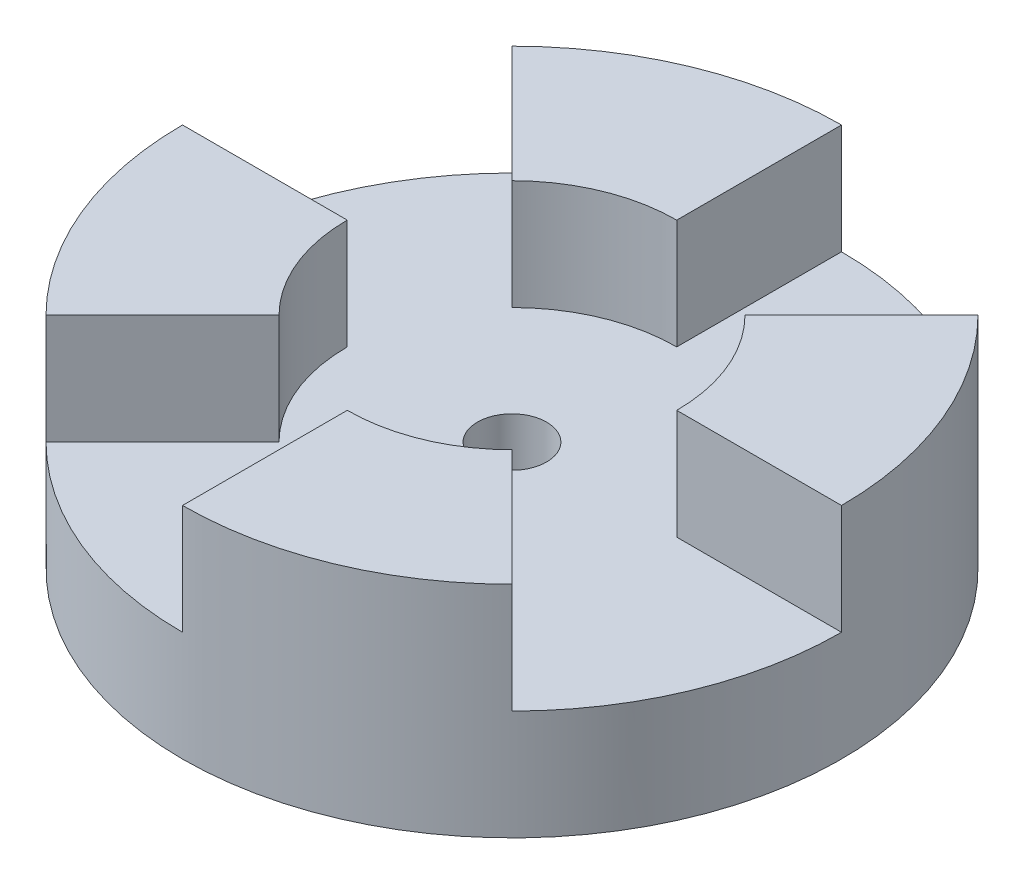
ISO-10303-21;
HEADER;
FILE_DESCRIPTION(('STEP AP214'),'2;1');
FILE_NAME('part.step','',(''),(''),'','','');
FILE_SCHEMA(('AUTOMOTIVE_DESIGN { 1 0 10303 214 1 1 1 1 }'));
ENDSEC;
DATA;
#1=APPLICATION_CONTEXT('core data for automotive mechanical design processes');
#2=APPLICATION_PROTOCOL_DEFINITION('international standard','automotive_design',2000,#1);
#3=PRODUCT_CONTEXT('',#1,'mechanical');
#4=PRODUCT('Part','Part','',(#3));
#5=PRODUCT_RELATED_PRODUCT_CATEGORY('part','',(#4));
#6=PRODUCT_DEFINITION_FORMATION('','',#4);
#7=PRODUCT_DEFINITION_CONTEXT('part definition',#1,'design');
#8=PRODUCT_DEFINITION('design','',#6,#7);
#9=PRODUCT_DEFINITION_SHAPE('','',#8);
#10=(LENGTH_UNIT() NAMED_UNIT(*) SI_UNIT(.MILLI.,.METRE.));
#11=(NAMED_UNIT(*) PLANE_ANGLE_UNIT() SI_UNIT($,.RADIAN.));
#12=(NAMED_UNIT(*) SI_UNIT($,.STERADIAN.) SOLID_ANGLE_UNIT());
#13=UNCERTAINTY_MEASURE_WITH_UNIT(LENGTH_MEASURE(1.E-05),#10,'distance_accuracy_value','');
#14=(GEOMETRIC_REPRESENTATION_CONTEXT(3) GLOBAL_UNCERTAINTY_ASSIGNED_CONTEXT((#13)) GLOBAL_UNIT_ASSIGNED_CONTEXT((#10,
#11,#12)) REPRESENTATION_CONTEXT('',''));
#15=CARTESIAN_POINT('',(0.,0.,0.));
#16=DIRECTION('',(0.,0.,1.));
#17=DIRECTION('',(1.,0.,0.));
#18=AXIS2_PLACEMENT_3D('',#15,#16,#17);
#19=CARTESIAN_POINT('',(-80.7898587765487,0.,8.41561028922383));
#20=DIRECTION('',(0.,1.,0.));
#21=DIRECTION('',(0.,0.,1.));
#22=AXIS2_PLACEMENT_3D('',#19,#20,#21);
#23=CYLINDRICAL_SURFACE('',#22,4.00050000000001);
#24=CARTESIAN_POINT('',(-80.7898587765487,12.7,8.41561028922383));
#25=DIRECTION('',(0.,1.,0.));
#26=DIRECTION('',(0.,0.,1.));
#27=AXIS2_PLACEMENT_3D('',#24,#25,#26);
#28=CIRCLE('',#27,4.00050000000001);
#29=CARTESIAN_POINT('',(-80.7898587765487,12.7,12.4161102892238));
#30=VERTEX_POINT('',#29);
#31=EDGE_CURVE('E350',#30,#30,#28,.T.);
#32=ORIENTED_EDGE('',*,*,#31,.T.);
#33=EDGE_LOOP('',(#32));
#34=FACE_BOUND('',#33,.T.);
#35=CARTESIAN_POINT('',(-80.7898587765487,2.54,8.41561028922383));
#36=DIRECTION('',(0.,-1.,0.));
#37=DIRECTION('',(0.,0.,-1.));
#38=AXIS2_PLACEMENT_3D('',#35,#36,#37);
#39=CIRCLE('',#38,4.00050000000001);
#40=CARTESIAN_POINT('',(-80.7898587765487,2.54,4.41511028922382));
#41=VERTEX_POINT('',#40);
#42=EDGE_CURVE('E38',#41,#41,#39,.F.);
#43=ORIENTED_EDGE('',*,*,#42,.F.);
#44=EDGE_LOOP('',(#43));
#45=FACE_BOUND('',#44,.T.);
#46=ADVANCED_FACE('F34',(#34,#45),#23,.F.);
#47=CARTESIAN_POINT('',(-80.7898587765487,12.7,8.41561028922383));
#48=DIRECTION('',(0.,1.,0.));
#49=DIRECTION('',(0.,0.,1.));
#50=AXIS2_PLACEMENT_3D('',#47,#48,#49);
#51=PLANE('',#50);
#52=ORIENTED_EDGE('',*,*,#31,.F.);
#53=EDGE_LOOP('',(#52));
#54=FACE_BOUND('',#53,.T.);
#55=CARTESIAN_POINT('',(-80.7898587765487,12.7,8.41561028922383));
#56=DIRECTION('',(0.,1.,0.));
#57=DIRECTION('',(0.,0.,1.));
#58=AXIS2_PLACEMENT_3D('',#55,#56,#57);
#59=CIRCLE('',#58,38.1);
#60=CARTESIAN_POINT('',(-107.730627139756,12.7,-18.5251580739836));
#61=VERTEX_POINT('',#60);
#62=CARTESIAN_POINT('',(-118.889858776549,12.7,8.41561028922383));
#63=VERTEX_POINT('',#62);
#64=EDGE_CURVE('E11',#61,#63,#59,.T.);
#65=ORIENTED_EDGE('',*,*,#64,.T.);
#66=DIRECTION('',(-1.,0.,0.));
#67=VECTOR('',#66,1.);
#68=CARTESIAN_POINT('',(-164.751280132786,12.7,8.41561028922383));
#69=LINE('',#68,#67);
#70=CARTESIAN_POINT('',(-99.8398587765487,12.7,8.41561028922383));
#71=VERTEX_POINT('',#70);
#72=EDGE_CURVE('E50',#71,#63,#69,.T.);
#73=ORIENTED_EDGE('',*,*,#72,.F.);
#74=CARTESIAN_POINT('',(-80.7898587765487,12.7,8.41561028922383));
#75=DIRECTION('',(0.,1.,0.));
#76=DIRECTION('',(0.,0.,1.));
#77=AXIS2_PLACEMENT_3D('',#74,#75,#76);
#78=CIRCLE('',#77,19.05);
#79=CARTESIAN_POINT('',(-94.2602429581524,12.7,21.8859944708276));
#80=VERTEX_POINT('',#79);
#81=EDGE_CURVE('E55',#71,#80,#78,.T.);
#82=ORIENTED_EDGE('',*,*,#81,.T.);
#83=DIRECTION('',(-0.707106781186548,0.,0.707106781186548));
#84=VECTOR('',#83,1.);
#85=CARTESIAN_POINT('',(-122.770569454667,12.7,50.3963209673425));
#86=LINE('',#85,#84);
#87=CARTESIAN_POINT('',(-107.730627139756,12.7,35.3563786524313));
#88=VERTEX_POINT('',#87);
#89=EDGE_CURVE('E168',#80,#88,#86,.T.);
#90=ORIENTED_EDGE('',*,*,#89,.T.);
#91=CARTESIAN_POINT('',(-80.7898587765487,12.7,46.5156102892238));
#92=VERTEX_POINT('',#91);
#93=EDGE_CURVE('E43',#88,#92,#59,.T.);
#94=ORIENTED_EDGE('',*,*,#93,.T.);
#95=DIRECTION('',(0.,0.,1.));
#96=VECTOR('',#95,1.);
#97=CARTESIAN_POINT('',(-80.7898587765487,12.7,8.41561028922383));
#98=LINE('',#97,#96);
#99=CARTESIAN_POINT('',(-80.7898587765487,12.7,27.4656102892238));
#100=VERTEX_POINT('',#99);
#101=EDGE_CURVE('E198',#100,#92,#98,.T.);
#102=ORIENTED_EDGE('',*,*,#101,.F.);
#103=CARTESIAN_POINT('',(-80.7898587765487,12.7,8.41561028922381));
#104=DIRECTION('',(0.,1.,0.));
#105=DIRECTION('',(0.,0.,1.));
#106=AXIS2_PLACEMENT_3D('',#103,#104,#105);
#107=CIRCLE('',#106,19.05);
#108=CARTESIAN_POINT('',(-67.319474594945,12.7,21.8859944708276));
#109=VERTEX_POINT('',#108);
#110=EDGE_CURVE('E154',#100,#109,#107,.T.);
#111=ORIENTED_EDGE('',*,*,#110,.T.);
#112=DIRECTION('',(0.707106781186547,0.,0.707106781186548));
#113=VECTOR('',#112,1.);
#114=CARTESIAN_POINT('',(-122.770569454667,12.7,-33.5651003888948));
#115=LINE('',#114,#113);
#116=CARTESIAN_POINT('',(-53.8490904133412,12.7,35.3563786524313));
#117=VERTEX_POINT('',#116);
#118=EDGE_CURVE('E189',#109,#117,#115,.T.);
#119=ORIENTED_EDGE('',*,*,#118,.T.);
#120=CARTESIAN_POINT('',(-42.6898587765487,12.7,8.41561028922383));
#121=VERTEX_POINT('',#120);
#122=EDGE_CURVE('E282',#117,#121,#59,.T.);
#123=ORIENTED_EDGE('',*,*,#122,.T.);
#124=DIRECTION('',(1.,0.,0.));
#125=VECTOR('',#124,1.);
#126=CARTESIAN_POINT('',(-164.751280132786,12.7,8.41561028922383));
#127=LINE('',#126,#125);
#128=CARTESIAN_POINT('',(-61.7398587765487,12.7,8.41561028922383));
#129=VERTEX_POINT('',#128);
#130=EDGE_CURVE('E219',#129,#121,#127,.T.);
#131=ORIENTED_EDGE('',*,*,#130,.F.);
#132=CARTESIAN_POINT('',(-80.7898587765487,12.7,8.41561028922383));
#133=DIRECTION('',(0.,1.,0.));
#134=DIRECTION('',(0.,0.,1.));
#135=AXIS2_PLACEMENT_3D('',#132,#133,#134);
#136=CIRCLE('',#135,19.05);
#137=CARTESIAN_POINT('',(-67.3194745949449,12.7,-5.0547738923799));
#138=VERTEX_POINT('',#137);
#139=EDGE_CURVE('E228',#138,#129,#136,.F.);
#140=ORIENTED_EDGE('',*,*,#139,.F.);
#141=DIRECTION('',(0.707106781186548,0.,-0.707106781186548));
#142=VECTOR('',#141,1.);
#143=CARTESIAN_POINT('',(-122.770569454667,12.7,50.3963209673425));
#144=LINE('',#143,#142);
#145=CARTESIAN_POINT('',(-53.8490904133412,12.7,-18.5251580739836));
#146=VERTEX_POINT('',#145);
#147=EDGE_CURVE('E214',#138,#146,#144,.T.);
#148=ORIENTED_EDGE('',*,*,#147,.T.);
#149=CARTESIAN_POINT('',(-80.7898587765487,12.7,-29.6843897107762));
#150=VERTEX_POINT('',#149);
#151=EDGE_CURVE('E280',#146,#150,#59,.T.);
#152=ORIENTED_EDGE('',*,*,#151,.T.);
#153=DIRECTION('',(0.,0.,-1.));
#154=VECTOR('',#153,1.);
#155=CARTESIAN_POINT('',(-80.7898587765487,12.7,8.41561028922383));
#156=LINE('',#155,#154);
#157=CARTESIAN_POINT('',(-80.7898587765487,12.7,-10.6343897107762));
#158=VERTEX_POINT('',#157);
#159=EDGE_CURVE('E258',#158,#150,#156,.T.);
#160=ORIENTED_EDGE('',*,*,#159,.F.);
#161=CARTESIAN_POINT('',(-80.7898587765487,12.7,8.41561028922383));
#162=DIRECTION('',(0.,1.,0.));
#163=DIRECTION('',(0.,0.,1.));
#164=AXIS2_PLACEMENT_3D('',#161,#162,#163);
#165=CIRCLE('',#164,19.05);
#166=CARTESIAN_POINT('',(-94.2602429581524,12.7,-5.05477389237991));
#167=VERTEX_POINT('',#166);
#168=EDGE_CURVE('E244',#158,#167,#165,.T.);
#169=ORIENTED_EDGE('',*,*,#168,.T.);
#170=DIRECTION('',(-0.707106781186548,0.,-0.707106781186547));
#171=VECTOR('',#170,1.);
#172=CARTESIAN_POINT('',(-122.770569454667,12.7,-33.5651003888948));
#173=LINE('',#172,#171);
#174=EDGE_CURVE('E249',#167,#61,#173,.T.);
#175=ORIENTED_EDGE('',*,*,#174,.T.);
#176=EDGE_LOOP('',(#65,#73,#82,#90,#94,#102,#111,#119,#123,#131,#140,#148,#152,#160,#169,#175));
#177=FACE_BOUND('',#176,.T.);
#178=ADVANCED_FACE('F290',(#54,#177),#51,.T.);
#179=CARTESIAN_POINT('',(-80.7898587765487,12.7,8.41561028922383));
#180=DIRECTION('',(0.,-1.,0.));
#181=DIRECTION('',(0.,0.,-1.));
#182=AXIS2_PLACEMENT_3D('',#179,#180,#181);
#183=CYLINDRICAL_SURFACE('',#182,38.1);
#184=ORIENTED_EDGE('',*,*,#64,.F.);
#185=DIRECTION('',(0.,-1.,0.));
#186=VECTOR('',#185,1.);
#187=CARTESIAN_POINT('',(-107.730627139756,25.4,-18.5251580739836));
#188=LINE('',#187,#186);
#189=CARTESIAN_POINT('',(-107.730627139756,25.4,-18.5251580739836));
#190=VERTEX_POINT('',#189);
#191=EDGE_CURVE('E270',#190,#61,#188,.T.);
#192=ORIENTED_EDGE('',*,*,#191,.F.);
#193=CARTESIAN_POINT('',(-80.7898587765487,25.4,8.41561028922383));
#194=DIRECTION('',(0.,1.,0.));
#195=DIRECTION('',(0.,0.,1.));
#196=AXIS2_PLACEMENT_3D('',#193,#194,#195);
#197=CIRCLE('',#196,38.1);
#198=CARTESIAN_POINT('',(-80.7898587765487,25.4,-29.6843897107762));
#199=VERTEX_POINT('',#198);
#200=EDGE_CURVE('E251',#199,#190,#197,.T.);
#201=ORIENTED_EDGE('',*,*,#200,.F.);
#202=DIRECTION('',(0.,-1.,0.));
#203=VECTOR('',#202,1.);
#204=CARTESIAN_POINT('',(-80.7898587765487,25.4,-29.6843897107762));
#205=LINE('',#204,#203);
#206=EDGE_CURVE('E266',#199,#150,#205,.T.);
#207=ORIENTED_EDGE('',*,*,#206,.T.);
#208=ORIENTED_EDGE('',*,*,#151,.F.);
#209=DIRECTION('',(0.,-1.,0.));
#210=VECTOR('',#209,1.);
#211=CARTESIAN_POINT('',(-53.8490904133412,25.4,-18.5251580739836));
#212=LINE('',#211,#210);
#213=CARTESIAN_POINT('',(-53.8490904133412,25.4,-18.5251580739836));
#214=VERTEX_POINT('',#213);
#215=EDGE_CURVE('E225',#214,#146,#212,.T.);
#216=ORIENTED_EDGE('',*,*,#215,.F.);
#217=CARTESIAN_POINT('',(-80.7898587765487,25.4,8.41561028922383));
#218=DIRECTION('',(0.,1.,0.));
#219=DIRECTION('',(0.,0.,1.));
#220=AXIS2_PLACEMENT_3D('',#217,#218,#219);
#221=CIRCLE('',#220,38.1);
#222=CARTESIAN_POINT('',(-42.6898587765487,25.4,8.41561028922383));
#223=VERTEX_POINT('',#222);
#224=EDGE_CURVE('E223',#223,#214,#221,.T.);
#225=ORIENTED_EDGE('',*,*,#224,.F.);
#226=DIRECTION('',(0.,-1.,0.));
#227=VECTOR('',#226,1.);
#228=CARTESIAN_POINT('',(-42.6898587765487,25.4,8.41561028922383));
#229=LINE('',#228,#227);
#230=EDGE_CURVE('E235',#223,#121,#229,.T.);
#231=ORIENTED_EDGE('',*,*,#230,.T.);
#232=ORIENTED_EDGE('',*,*,#122,.F.);
#233=DIRECTION('',(0.,-1.,0.));
#234=VECTOR('',#233,1.);
#235=CARTESIAN_POINT('',(-53.8490904133412,25.4,35.3563786524313));
#236=LINE('',#235,#234);
#237=CARTESIAN_POINT('',(-53.8490904133412,25.4,35.3563786524313));
#238=VERTEX_POINT('',#237);
#239=EDGE_CURVE('E205',#238,#117,#236,.T.);
#240=ORIENTED_EDGE('',*,*,#239,.F.);
#241=CARTESIAN_POINT('',(-80.7898587765487,25.4,8.41561028922383));
#242=DIRECTION('',(0.,1.,0.));
#243=DIRECTION('',(0.,0.,1.));
#244=AXIS2_PLACEMENT_3D('',#241,#242,#243);
#245=CIRCLE('',#244,38.1);
#246=CARTESIAN_POINT('',(-80.7898587765487,25.4,46.5156102892238));
#247=VERTEX_POINT('',#246);
#248=EDGE_CURVE('E191',#247,#238,#245,.T.);
#249=ORIENTED_EDGE('',*,*,#248,.F.);
#250=DIRECTION('',(0.,-1.,0.));
#251=VECTOR('',#250,1.);
#252=CARTESIAN_POINT('',(-80.7898587765487,25.4,46.5156102892238));
#253=LINE('',#252,#251);
#254=EDGE_CURVE('E208',#247,#92,#253,.T.);
#255=ORIENTED_EDGE('',*,*,#254,.T.);
#256=ORIENTED_EDGE('',*,*,#93,.F.);
#257=DIRECTION('',(0.,-1.,0.));
#258=VECTOR('',#257,1.);
#259=CARTESIAN_POINT('',(-107.730627139756,25.4,35.3563786524313));
#260=LINE('',#259,#258);
#261=CARTESIAN_POINT('',(-107.730627139756,25.4,35.3563786524313));
#262=VERTEX_POINT('',#261);
#263=EDGE_CURVE('E181',#262,#88,#260,.T.);
#264=ORIENTED_EDGE('',*,*,#263,.F.);
#265=CARTESIAN_POINT('',(-80.7898587765487,25.4,8.41561028922383));
#266=DIRECTION('',(0.,1.,0.));
#267=DIRECTION('',(0.,0.,1.));
#268=AXIS2_PLACEMENT_3D('',#265,#266,#267);
#269=CIRCLE('',#268,38.1);
#270=CARTESIAN_POINT('',(-118.889858776549,25.4,8.41561028922383));
#271=VERTEX_POINT('',#270);
#272=EDGE_CURVE('E163',#271,#262,#269,.T.);
#273=ORIENTED_EDGE('',*,*,#272,.F.);
#274=DIRECTION('',(0.,-1.,0.));
#275=VECTOR('',#274,1.);
#276=CARTESIAN_POINT('',(-118.889858776549,25.4,8.41561028922383));
#277=LINE('',#276,#275);
#278=EDGE_CURVE('E155',#271,#63,#277,.T.);
#279=ORIENTED_EDGE('',*,*,#278,.T.);
#280=EDGE_LOOP('',(#184,#192,#201,#207,#208,#216,#225,#231,#232,#240,#249,#255,#256,#264,#273,#279));
#281=FACE_BOUND('',#280,.T.);
#282=CARTESIAN_POINT('',(-80.7898587765487,0.,8.41561028922383));
#283=DIRECTION('',(0.,1.,0.));
#284=DIRECTION('',(0.,0.,1.));
#285=AXIS2_PLACEMENT_3D('',#282,#283,#284);
#286=CIRCLE('',#285,38.1);
#287=CARTESIAN_POINT('',(-80.7898587765487,0.,46.5156102892238));
#288=VERTEX_POINT('',#287);
#289=EDGE_CURVE('E283',#288,#288,#286,.T.);
#290=ORIENTED_EDGE('',*,*,#289,.T.);
#291=EDGE_LOOP('',(#290));
#292=FACE_BOUND('',#291,.T.);
#293=ADVANCED_FACE('F36',(#281,#292),#183,.T.);
#294=CARTESIAN_POINT('',(-80.7898587765487,0.,8.41561028922383));
#295=DIRECTION('',(0.,1.,0.));
#296=DIRECTION('',(0.,0.,1.));
#297=AXIS2_PLACEMENT_3D('',#294,#295,#296);
#298=PLANE('',#297);
#299=CARTESIAN_POINT('',(-80.7898587765487,0.,8.41561028922383));
#300=DIRECTION('',(0.,-1.,0.));
#301=DIRECTION('',(0.,0.,-1.));
#302=AXIS2_PLACEMENT_3D('',#299,#300,#301);
#303=CIRCLE('',#302,5.33400000000001);
#304=CARTESIAN_POINT('',(-80.7898587765487,0.,3.08161028922382));
#305=VERTEX_POINT('',#304);
#306=EDGE_CURVE('E172',#305,#305,#303,.T.);
#307=ORIENTED_EDGE('',*,*,#306,.F.);
#308=EDGE_LOOP('',(#307));
#309=FACE_BOUND('',#308,.T.);
#310=ORIENTED_EDGE('',*,*,#289,.F.);
#311=EDGE_LOOP('',(#310));
#312=FACE_BOUND('',#311,.T.);
#313=ADVANCED_FACE('F336',(#309,#312),#298,.F.);
#314=CARTESIAN_POINT('',(-80.7898587765487,25.4,8.41561028922383));
#315=DIRECTION('',(0.,-1.,0.));
#316=DIRECTION('',(0.,0.,-1.));
#317=AXIS2_PLACEMENT_3D('',#314,#315,#316);
#318=CYLINDRICAL_SURFACE('',#317,19.05);
#319=ORIENTED_EDGE('',*,*,#168,.F.);
#320=DIRECTION('',(0.,-1.,0.));
#321=VECTOR('',#320,1.);
#322=CARTESIAN_POINT('',(-80.7898587765487,25.4,-10.6343897107762));
#323=LINE('',#322,#321);
#324=CARTESIAN_POINT('',(-80.7898587765487,25.4,-10.6343897107762));
#325=VERTEX_POINT('',#324);
#326=EDGE_CURVE('E269',#325,#158,#323,.T.);
#327=ORIENTED_EDGE('',*,*,#326,.F.);
#328=CARTESIAN_POINT('',(-80.7898587765487,25.4,8.41561028922383));
#329=DIRECTION('',(0.,1.,0.));
#330=DIRECTION('',(0.,0.,1.));
#331=AXIS2_PLACEMENT_3D('',#328,#329,#330);
#332=CIRCLE('',#331,19.05);
#333=CARTESIAN_POINT('',(-94.2602429581524,25.4,-5.05477389237991));
#334=VERTEX_POINT('',#333);
#335=EDGE_CURVE('E245',#325,#334,#332,.T.);
#336=ORIENTED_EDGE('',*,*,#335,.T.);
#337=DIRECTION('',(0.,-1.,0.));
#338=VECTOR('',#337,1.);
#339=CARTESIAN_POINT('',(-94.2602429581524,25.4,-5.05477389237991));
#340=LINE('',#339,#338);
#341=EDGE_CURVE('E256',#334,#167,#340,.T.);
#342=ORIENTED_EDGE('',*,*,#341,.T.);
#343=EDGE_LOOP('',(#319,#327,#336,#342));
#344=FACE_BOUND('',#343,.T.);
#345=ADVANCED_FACE('F334',(#344),#318,.F.);
#346=CARTESIAN_POINT('',(-80.7898587765487,25.4,8.41561028922383));
#347=DIRECTION('',(-1.,0.,0.));
#348=DIRECTION('',(0.,0.,1.));
#349=AXIS2_PLACEMENT_3D('',#346,#347,#348);
#350=PLANE('',#349);
#351=ORIENTED_EDGE('',*,*,#159,.T.);
#352=ORIENTED_EDGE('',*,*,#206,.F.);
#353=DIRECTION('',(0.,0.,-1.));
#354=VECTOR('',#353,1.);
#355=CARTESIAN_POINT('',(-80.7898587765487,25.4,8.41561028922383));
#356=LINE('',#355,#354);
#357=EDGE_CURVE('E248',#325,#199,#356,.T.);
#358=ORIENTED_EDGE('',*,*,#357,.F.);
#359=ORIENTED_EDGE('',*,*,#326,.T.);
#360=EDGE_LOOP('',(#351,#352,#358,#359));
#361=FACE_BOUND('',#360,.T.);
#362=ADVANCED_FACE('F343',(#361),#350,.F.);
#363=CARTESIAN_POINT('',(-122.770569454667,25.4,-33.5651003888948));
#364=DIRECTION('',(-0.707106781186547,0.,0.707106781186548));
#365=DIRECTION('',(0.707106781186548,0.,0.707106781186547));
#366=AXIS2_PLACEMENT_3D('',#363,#364,#365);
#367=PLANE('',#366);
#368=ORIENTED_EDGE('',*,*,#174,.F.);
#369=ORIENTED_EDGE('',*,*,#341,.F.);
#370=DIRECTION('',(-0.707106781186548,0.,-0.707106781186547));
#371=VECTOR('',#370,1.);
#372=CARTESIAN_POINT('',(-122.770569454667,25.4,-33.5651003888948));
#373=LINE('',#372,#371);
#374=EDGE_CURVE('E253',#334,#190,#373,.T.);
#375=ORIENTED_EDGE('',*,*,#374,.T.);
#376=ORIENTED_EDGE('',*,*,#191,.T.);
#377=EDGE_LOOP('',(#368,#369,#375,#376));
#378=FACE_BOUND('',#377,.T.);
#379=ADVANCED_FACE('F320',(#378),#367,.T.);
#380=CARTESIAN_POINT('',(-164.751280132786,25.4,8.41561028922383));
#381=DIRECTION('',(0.,1.,0.));
#382=DIRECTION('',(0.,0.,1.));
#383=AXIS2_PLACEMENT_3D('',#380,#381,#382);
#384=PLANE('',#383);
#385=ORIENTED_EDGE('',*,*,#335,.F.);
#386=ORIENTED_EDGE('',*,*,#357,.T.);
#387=ORIENTED_EDGE('',*,*,#200,.T.);
#388=ORIENTED_EDGE('',*,*,#374,.F.);
#389=EDGE_LOOP('',(#385,#386,#387,#388));
#390=FACE_BOUND('',#389,.T.);
#391=ADVANCED_FACE('F313',(#390),#384,.T.);
#392=CARTESIAN_POINT('',(-122.770569454667,25.4,50.3963209673425));
#393=DIRECTION('',(-0.707106781186548,0.,-0.707106781186548));
#394=DIRECTION('',(-0.707106781186548,0.,0.707106781186548));
#395=AXIS2_PLACEMENT_3D('',#392,#393,#394);
#396=PLANE('',#395);
#397=ORIENTED_EDGE('',*,*,#147,.F.);
#398=DIRECTION('',(0.,-1.,0.));
#399=VECTOR('',#398,1.);
#400=CARTESIAN_POINT('',(-67.3194745949449,25.4,-5.0547738923799));
#401=LINE('',#400,#399);
#402=CARTESIAN_POINT('',(-67.3194745949449,25.4,-5.0547738923799));
#403=VERTEX_POINT('',#402);
#404=EDGE_CURVE('E241',#403,#138,#401,.T.);
#405=ORIENTED_EDGE('',*,*,#404,.F.);
#406=DIRECTION('',(0.707106781186548,0.,-0.707106781186548));
#407=VECTOR('',#406,1.);
#408=CARTESIAN_POINT('',(-122.770569454667,25.4,50.3963209673425));
#409=LINE('',#408,#407);
#410=EDGE_CURVE('E215',#403,#214,#409,.T.);
#411=ORIENTED_EDGE('',*,*,#410,.T.);
#412=ORIENTED_EDGE('',*,*,#215,.T.);
#413=EDGE_LOOP('',(#397,#405,#411,#412));
#414=FACE_BOUND('',#413,.T.);
#415=ADVANCED_FACE('F311',(#414),#396,.T.);
#416=CARTESIAN_POINT('',(-80.7898587765487,25.4,8.41561028922383));
#417=DIRECTION('',(0.,-1.,0.));
#418=DIRECTION('',(0.,0.,-1.));
#419=AXIS2_PLACEMENT_3D('',#416,#417,#418);
#420=CYLINDRICAL_SURFACE('',#419,19.05);
#421=ORIENTED_EDGE('',*,*,#139,.T.);
#422=DIRECTION('',(0.,-1.,0.));
#423=VECTOR('',#422,1.);
#424=CARTESIAN_POINT('',(-61.7398587765487,25.4,8.41561028922383));
#425=LINE('',#424,#423);
#426=CARTESIAN_POINT('',(-61.7398587765487,25.4,8.41561028922383));
#427=VERTEX_POINT('',#426);
#428=EDGE_CURVE('E238',#427,#129,#425,.T.);
#429=ORIENTED_EDGE('',*,*,#428,.F.);
#430=CARTESIAN_POINT('',(-80.7898587765487,25.4,8.41561028922383));
#431=DIRECTION('',(0.,1.,0.));
#432=DIRECTION('',(0.,0.,1.));
#433=AXIS2_PLACEMENT_3D('',#430,#431,#432);
#434=CIRCLE('',#433,19.05);
#435=EDGE_CURVE('E218',#403,#427,#434,.F.);
#436=ORIENTED_EDGE('',*,*,#435,.F.);
#437=ORIENTED_EDGE('',*,*,#404,.T.);
#438=EDGE_LOOP('',(#421,#429,#436,#437));
#439=FACE_BOUND('',#438,.T.);
#440=ADVANCED_FACE('F308',(#439),#420,.F.);
#441=CARTESIAN_POINT('',(-164.751280132786,25.4,8.41561028922383));
#442=DIRECTION('',(0.,0.,-1.));
#443=DIRECTION('',(-1.,0.,0.));
#444=AXIS2_PLACEMENT_3D('',#441,#442,#443);
#445=PLANE('',#444);
#446=ORIENTED_EDGE('',*,*,#130,.T.);
#447=ORIENTED_EDGE('',*,*,#230,.F.);
#448=DIRECTION('',(1.,0.,0.));
#449=VECTOR('',#448,1.);
#450=CARTESIAN_POINT('',(-164.751280132786,25.4,8.41561028922383));
#451=LINE('',#450,#449);
#452=EDGE_CURVE('E221',#427,#223,#451,.T.);
#453=ORIENTED_EDGE('',*,*,#452,.F.);
#454=ORIENTED_EDGE('',*,*,#428,.T.);
#455=EDGE_LOOP('',(#446,#447,#453,#454));
#456=FACE_BOUND('',#455,.T.);
#457=ADVANCED_FACE('F296',(#456),#445,.F.);
#458=CARTESIAN_POINT('',(-164.751280132786,25.4,8.41561028922383));
#459=DIRECTION('',(0.,1.,0.));
#460=DIRECTION('',(0.,0.,1.));
#461=AXIS2_PLACEMENT_3D('',#458,#459,#460);
#462=PLANE('',#461);
#463=ORIENTED_EDGE('',*,*,#410,.F.);
#464=ORIENTED_EDGE('',*,*,#435,.T.);
#465=ORIENTED_EDGE('',*,*,#452,.T.);
#466=ORIENTED_EDGE('',*,*,#224,.T.);
#467=EDGE_LOOP('',(#463,#464,#465,#466));
#468=FACE_BOUND('',#467,.T.);
#469=ADVANCED_FACE('F305',(#468),#462,.T.);
#470=CARTESIAN_POINT('',(-80.7898587765487,25.4,8.41561028922381));
#471=DIRECTION('',(0.,-1.,0.));
#472=DIRECTION('',(0.,0.,-1.));
#473=AXIS2_PLACEMENT_3D('',#470,#471,#472);
#474=CYLINDRICAL_SURFACE('',#473,19.05);
#475=ORIENTED_EDGE('',*,*,#110,.F.);
#476=DIRECTION('',(0.,-1.,0.));
#477=VECTOR('',#476,1.);
#478=CARTESIAN_POINT('',(-80.7898587765487,25.4,27.4656102892238));
#479=LINE('',#478,#477);
#480=CARTESIAN_POINT('',(-80.7898587765487,25.4,27.4656102892238));
#481=VERTEX_POINT('',#480);
#482=EDGE_CURVE('E211',#481,#100,#479,.T.);
#483=ORIENTED_EDGE('',*,*,#482,.F.);
#484=CARTESIAN_POINT('',(-80.7898587765487,25.4,8.41561028922381));
#485=DIRECTION('',(0.,1.,0.));
#486=DIRECTION('',(0.,0.,1.));
#487=AXIS2_PLACEMENT_3D('',#484,#485,#486);
#488=CIRCLE('',#487,19.05);
#489=CARTESIAN_POINT('',(-67.319474594945,25.4,21.8859944708276));
#490=VERTEX_POINT('',#489);
#491=EDGE_CURVE('E185',#481,#490,#488,.T.);
#492=ORIENTED_EDGE('',*,*,#491,.T.);
#493=DIRECTION('',(0.,-1.,0.));
#494=VECTOR('',#493,1.);
#495=CARTESIAN_POINT('',(-67.319474594945,25.4,21.8859944708276));
#496=LINE('',#495,#494);
#497=EDGE_CURVE('E196',#490,#109,#496,.T.);
#498=ORIENTED_EDGE('',*,*,#497,.T.);
#499=EDGE_LOOP('',(#475,#483,#492,#498));
#500=FACE_BOUND('',#499,.T.);
#501=ADVANCED_FACE('F454',(#500),#474,.F.);
#502=CARTESIAN_POINT('',(-80.7898587765487,25.4,8.41561028922383));
#503=DIRECTION('',(1.,0.,0.));
#504=DIRECTION('',(0.,0.,-1.));
#505=AXIS2_PLACEMENT_3D('',#502,#503,#504);
#506=PLANE('',#505);
#507=ORIENTED_EDGE('',*,*,#101,.T.);
#508=ORIENTED_EDGE('',*,*,#254,.F.);
#509=DIRECTION('',(0.,0.,1.));
#510=VECTOR('',#509,1.);
#511=CARTESIAN_POINT('',(-80.7898587765487,25.4,8.41561028922383));
#512=LINE('',#511,#510);
#513=EDGE_CURVE('E188',#481,#247,#512,.T.);
#514=ORIENTED_EDGE('',*,*,#513,.F.);
#515=ORIENTED_EDGE('',*,*,#482,.T.);
#516=EDGE_LOOP('',(#507,#508,#514,#515));
#517=FACE_BOUND('',#516,.T.);
#518=ADVANCED_FACE('F450',(#517),#506,.F.);
#519=CARTESIAN_POINT('',(-122.770569454667,25.4,-33.5651003888948));
#520=DIRECTION('',(0.707106781186548,0.,-0.707106781186547));
#521=DIRECTION('',(-0.707106781186547,0.,-0.707106781186548));
#522=AXIS2_PLACEMENT_3D('',#519,#520,#521);
#523=PLANE('',#522);
#524=ORIENTED_EDGE('',*,*,#118,.F.);
#525=ORIENTED_EDGE('',*,*,#497,.F.);
#526=DIRECTION('',(0.707106781186547,0.,0.707106781186548));
#527=VECTOR('',#526,1.);
#528=CARTESIAN_POINT('',(-122.770569454667,25.4,-33.5651003888948));
#529=LINE('',#528,#527);
#530=EDGE_CURVE('E193',#490,#238,#529,.T.);
#531=ORIENTED_EDGE('',*,*,#530,.T.);
#532=ORIENTED_EDGE('',*,*,#239,.T.);
#533=EDGE_LOOP('',(#524,#525,#531,#532));
#534=FACE_BOUND('',#533,.T.);
#535=ADVANCED_FACE('F446',(#534),#523,.T.);
#536=CARTESIAN_POINT('',(-164.751280132786,25.4,8.41561028922383));
#537=DIRECTION('',(0.,1.,0.));
#538=DIRECTION('',(0.,0.,1.));
#539=AXIS2_PLACEMENT_3D('',#536,#537,#538);
#540=PLANE('',#539);
#541=ORIENTED_EDGE('',*,*,#491,.F.);
#542=ORIENTED_EDGE('',*,*,#513,.T.);
#543=ORIENTED_EDGE('',*,*,#248,.T.);
#544=ORIENTED_EDGE('',*,*,#530,.F.);
#545=EDGE_LOOP('',(#541,#542,#543,#544));
#546=FACE_BOUND('',#545,.T.);
#547=ADVANCED_FACE('F443',(#546),#540,.T.);
#548=CARTESIAN_POINT('',(-80.7898587765487,25.4,8.41561028922383));
#549=DIRECTION('',(0.,-1.,0.));
#550=DIRECTION('',(0.,0.,-1.));
#551=AXIS2_PLACEMENT_3D('',#548,#549,#550);
#552=CYLINDRICAL_SURFACE('',#551,19.05);
#553=ORIENTED_EDGE('',*,*,#81,.F.);
#554=DIRECTION('',(0.,-1.,0.));
#555=VECTOR('',#554,1.);
#556=CARTESIAN_POINT('',(-99.8398587765487,25.4,8.41561028922383));
#557=LINE('',#556,#555);
#558=CARTESIAN_POINT('',(-99.8398587765487,25.4,8.41561028922383));
#559=VERTEX_POINT('',#558);
#560=EDGE_CURVE('E147',#559,#71,#557,.T.);
#561=ORIENTED_EDGE('',*,*,#560,.F.);
#562=CARTESIAN_POINT('',(-80.7898587765487,25.4,8.41561028922383));
#563=DIRECTION('',(0.,1.,0.));
#564=DIRECTION('',(0.,0.,1.));
#565=AXIS2_PLACEMENT_3D('',#562,#563,#564);
#566=CIRCLE('',#565,19.05);
#567=CARTESIAN_POINT('',(-94.2602429581524,25.4,21.8859944708276));
#568=VERTEX_POINT('',#567);
#569=EDGE_CURVE('E151',#559,#568,#566,.T.);
#570=ORIENTED_EDGE('',*,*,#569,.T.);
#571=DIRECTION('',(0.,-1.,0.));
#572=VECTOR('',#571,1.);
#573=CARTESIAN_POINT('',(-94.2602429581524,25.4,21.8859944708276));
#574=LINE('',#573,#572);
#575=EDGE_CURVE('E177',#568,#80,#574,.T.);
#576=ORIENTED_EDGE('',*,*,#575,.T.);
#577=EDGE_LOOP('',(#553,#561,#570,#576));
#578=FACE_BOUND('',#577,.T.);
#579=ADVANCED_FACE('F149',(#578),#552,.F.);
#580=CARTESIAN_POINT('',(-164.751280132786,25.4,8.41561028922383));
#581=DIRECTION('',(0.,0.,1.));
#582=DIRECTION('',(1.,0.,0.));
#583=AXIS2_PLACEMENT_3D('',#580,#581,#582);
#584=PLANE('',#583);
#585=ORIENTED_EDGE('',*,*,#72,.T.);
#586=ORIENTED_EDGE('',*,*,#278,.F.);
#587=DIRECTION('',(-1.,0.,0.));
#588=VECTOR('',#587,1.);
#589=CARTESIAN_POINT('',(-164.751280132786,25.4,8.41561028922383));
#590=LINE('',#589,#588);
#591=EDGE_CURVE('E158',#559,#271,#590,.T.);
#592=ORIENTED_EDGE('',*,*,#591,.F.);
#593=ORIENTED_EDGE('',*,*,#560,.T.);
#594=EDGE_LOOP('',(#585,#586,#592,#593));
#595=FACE_BOUND('',#594,.T.);
#596=ADVANCED_FACE('F159',(#595),#584,.F.);
#597=CARTESIAN_POINT('',(-122.770569454667,25.4,50.3963209673425));
#598=DIRECTION('',(0.707106781186548,0.,0.707106781186548));
#599=DIRECTION('',(0.707106781186548,0.,-0.707106781186548));
#600=AXIS2_PLACEMENT_3D('',#597,#598,#599);
#601=PLANE('',#600);
#602=ORIENTED_EDGE('',*,*,#89,.F.);
#603=ORIENTED_EDGE('',*,*,#575,.F.);
#604=DIRECTION('',(-0.707106781186548,0.,0.707106781186548));
#605=VECTOR('',#604,1.);
#606=CARTESIAN_POINT('',(-122.770569454667,25.4,50.3963209673425));
#607=LINE('',#606,#605);
#608=EDGE_CURVE('E167',#568,#262,#607,.T.);
#609=ORIENTED_EDGE('',*,*,#608,.T.);
#610=ORIENTED_EDGE('',*,*,#263,.T.);
#611=EDGE_LOOP('',(#602,#603,#609,#610));
#612=FACE_BOUND('',#611,.T.);
#613=ADVANCED_FACE('F435',(#612),#601,.T.);
#614=CARTESIAN_POINT('',(-164.751280132786,25.4,8.41561028922383));
#615=DIRECTION('',(0.,1.,0.));
#616=DIRECTION('',(0.,0.,1.));
#617=AXIS2_PLACEMENT_3D('',#614,#615,#616);
#618=PLANE('',#617);
#619=ORIENTED_EDGE('',*,*,#569,.F.);
#620=ORIENTED_EDGE('',*,*,#591,.T.);
#621=ORIENTED_EDGE('',*,*,#272,.T.);
#622=ORIENTED_EDGE('',*,*,#608,.F.);
#623=EDGE_LOOP('',(#619,#620,#621,#622));
#624=FACE_BOUND('',#623,.T.);
#625=ADVANCED_FACE('F165',(#624),#618,.T.);
#626=CARTESIAN_POINT('',(-80.7898587765487,2.54,8.41561028922383));
#627=DIRECTION('',(0.,-1.,0.));
#628=DIRECTION('',(0.,0.,-1.));
#629=AXIS2_PLACEMENT_3D('',#626,#627,#628);
#630=PLANE('',#629);
#631=CARTESIAN_POINT('',(-80.7898587765487,2.54,8.41561028922383));
#632=DIRECTION('',(0.,-1.,0.));
#633=DIRECTION('',(0.,0.,-1.));
#634=AXIS2_PLACEMENT_3D('',#631,#632,#633);
#635=CIRCLE('',#634,5.33400000000001);
#636=CARTESIAN_POINT('',(-80.7898587765487,2.54,3.08161028922382));
#637=VERTEX_POINT('',#636);
#638=EDGE_CURVE('E557',#637,#637,#635,.T.);
#639=ORIENTED_EDGE('',*,*,#638,.T.);
#640=EDGE_LOOP('',(#639));
#641=FACE_BOUND('',#640,.T.);
#642=ORIENTED_EDGE('',*,*,#42,.T.);
#643=EDGE_LOOP('',(#642));
#644=FACE_BOUND('',#643,.T.);
#645=ADVANCED_FACE('F411',(#641,#644),#630,.T.);
#646=CARTESIAN_POINT('',(-80.7898587765487,2.54,8.41561028922383));
#647=DIRECTION('',(0.,-1.,0.));
#648=DIRECTION('',(0.,0.,-1.));
#649=AXIS2_PLACEMENT_3D('',#646,#647,#648);
#650=CYLINDRICAL_SURFACE('',#649,5.33400000000001);
#651=ORIENTED_EDGE('',*,*,#638,.F.);
#652=EDGE_LOOP('',(#651));
#653=FACE_BOUND('',#652,.T.);
#654=ORIENTED_EDGE('',*,*,#306,.T.);
#655=EDGE_LOOP('',(#654));
#656=FACE_BOUND('',#655,.T.);
#657=ADVANCED_FACE('F416',(#653,#656),#650,.F.);
#658=CLOSED_SHELL('',(#46,#178,#293,#313,#345,#362,#379,#391,#415,#440,#457,#469,#501,#518,#535,
#547,#579,#596,#613,#625,#645,#657));
#659=MANIFOLD_SOLID_BREP('B2',#658);
#660=ADVANCED_BREP_SHAPE_REPRESENTATION('',(#18,#659),#14);
#661=SHAPE_DEFINITION_REPRESENTATION(#9,#660);
ENDSEC;
END-ISO-10303-21;
